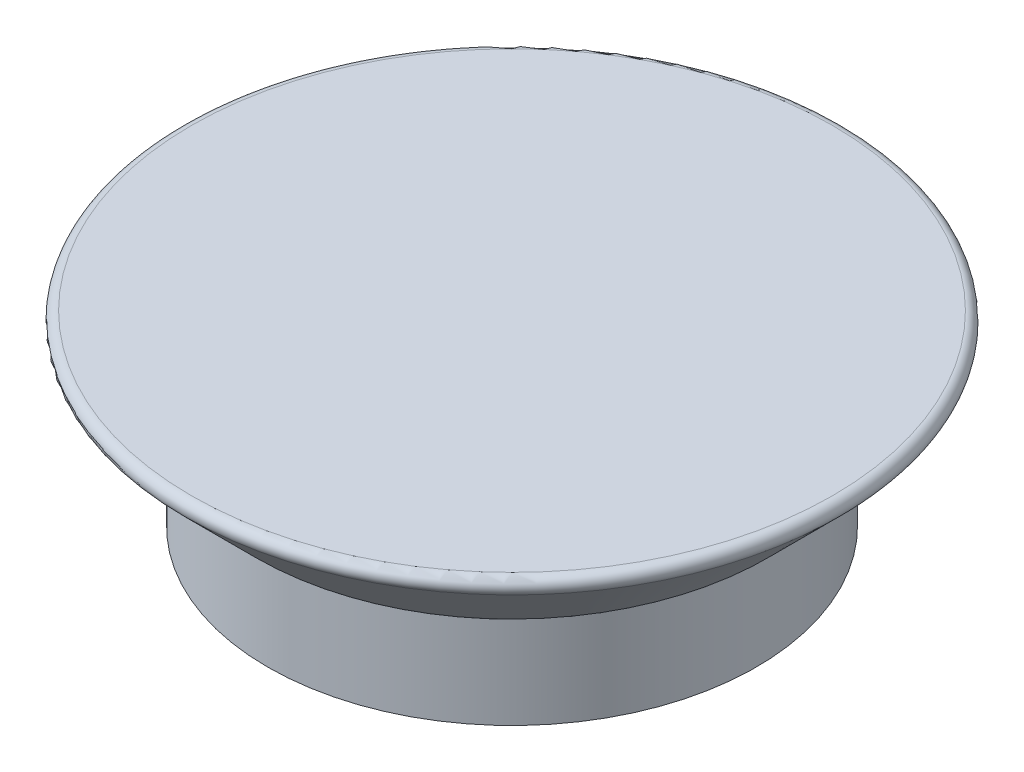
ISO-10303-21;
HEADER;
FILE_DESCRIPTION(('STEP AP214'),'2;1');
FILE_NAME('part.step','',(''),(''),'','','');
FILE_SCHEMA(('AUTOMOTIVE_DESIGN { 1 0 10303 214 1 1 1 1 }'));
ENDSEC;
DATA;
#1=APPLICATION_CONTEXT('core data for automotive mechanical design processes');
#2=APPLICATION_PROTOCOL_DEFINITION('international standard','automotive_design',2000,#1);
#3=PRODUCT_CONTEXT('',#1,'mechanical');
#4=PRODUCT('Part','Part','',(#3));
#5=PRODUCT_RELATED_PRODUCT_CATEGORY('part','',(#4));
#6=PRODUCT_DEFINITION_FORMATION('','',#4);
#7=PRODUCT_DEFINITION_CONTEXT('part definition',#1,'design');
#8=PRODUCT_DEFINITION('design','',#6,#7);
#9=PRODUCT_DEFINITION_SHAPE('','',#8);
#10=(LENGTH_UNIT() NAMED_UNIT(*) SI_UNIT(.MILLI.,.METRE.));
#11=(NAMED_UNIT(*) PLANE_ANGLE_UNIT() SI_UNIT($,.RADIAN.));
#12=(NAMED_UNIT(*) SI_UNIT($,.STERADIAN.) SOLID_ANGLE_UNIT());
#13=UNCERTAINTY_MEASURE_WITH_UNIT(LENGTH_MEASURE(1.E-05),#10,'distance_accuracy_value','');
#14=(GEOMETRIC_REPRESENTATION_CONTEXT(3) GLOBAL_UNCERTAINTY_ASSIGNED_CONTEXT((#13)) GLOBAL_UNIT_ASSIGNED_CONTEXT((#10,
#11,#12)) REPRESENTATION_CONTEXT('',''));
#15=CARTESIAN_POINT('',(0.,0.,0.));
#16=DIRECTION('',(0.,0.,1.));
#17=DIRECTION('',(1.,0.,0.));
#18=AXIS2_PLACEMENT_3D('',#15,#16,#17);
#19=CARTESIAN_POINT('',(0.,110.,0.));
#20=DIRECTION('',(0.,-1.,0.));
#21=DIRECTION('',(0.,0.,-1.));
#22=AXIS2_PLACEMENT_3D('',#19,#20,#21);
#23=CYLINDRICAL_SURFACE('',#22,275.);
#24=CARTESIAN_POINT('',(0.,110.,0.));
#25=DIRECTION('',(0.,1.,0.));
#26=DIRECTION('',(0.,0.,1.));
#27=AXIS2_PLACEMENT_3D('',#24,#25,#26);
#28=CIRCLE('',#27,275.);
#29=CARTESIAN_POINT('',(0.,110.,275.));
#30=VERTEX_POINT('',#29);
#31=EDGE_CURVE('E69',#30,#30,#28,.T.);
#32=ORIENTED_EDGE('',*,*,#31,.F.);
#33=EDGE_LOOP('',(#32));
#34=FACE_BOUND('',#33,.T.);
#35=CARTESIAN_POINT('',(0.,0.,0.));
#36=DIRECTION('',(0.,1.,0.));
#37=DIRECTION('',(0.,0.,1.));
#38=AXIS2_PLACEMENT_3D('',#35,#36,#37);
#39=CIRCLE('',#38,275.);
#40=CARTESIAN_POINT('',(0.,0.,275.));
#41=VERTEX_POINT('',#40);
#42=EDGE_CURVE('E70',#41,#41,#39,.T.);
#43=ORIENTED_EDGE('',*,*,#42,.T.);
#44=EDGE_LOOP('',(#43));
#45=FACE_BOUND('',#44,.T.);
#46=ADVANCED_FACE('F45',(#34,#45),#23,.T.);
#47=CARTESIAN_POINT('',(0.,0.,0.));
#48=DIRECTION('',(0.,1.,0.));
#49=DIRECTION('',(0.,0.,1.));
#50=AXIS2_PLACEMENT_3D('',#47,#48,#49);
#51=PLANE('',#50);
#52=ORIENTED_EDGE('',*,*,#42,.F.);
#53=EDGE_LOOP('',(#52));
#54=FACE_BOUND('',#53,.T.);
#55=ADVANCED_FACE('F82',(#54),#51,.F.);
#56=CARTESIAN_POINT('',(0.,210.,0.));
#57=DIRECTION('',(0.,1.,0.));
#58=DIRECTION('',(0.,0.,1.));
#59=AXIS2_PLACEMENT_3D('',#56,#57,#58);
#60=PLANE('',#59);
#61=CARTESIAN_POINT('',(0.,210.,0.));
#62=DIRECTION('',(0.,1.,0.));
#63=DIRECTION('',(0.,0.,1.));
#64=AXIS2_PLACEMENT_3D('',#61,#62,#63);
#65=CIRCLE('',#64,360.857864376269);
#66=CARTESIAN_POINT('',(0.,210.,360.857864376269));
#67=VERTEX_POINT('',#66);
#68=EDGE_CURVE('E53',#67,#67,#65,.T.);
#69=ORIENTED_EDGE('',*,*,#68,.T.);
#70=EDGE_LOOP('',(#69));
#71=FACE_BOUND('',#70,.T.);
#72=ADVANCED_FACE('F87',(#71),#60,.T.);
#73=CARTESIAN_POINT('',(0.,110.,0.));
#74=DIRECTION('',(0.,1.,0.));
#75=DIRECTION('',(0.,0.,1.));
#76=AXIS2_PLACEMENT_3D('',#73,#74,#75);
#77=PLANE('',#76);
#78=CARTESIAN_POINT('',(0.,110.,0.));
#79=DIRECTION('',(0.,1.,0.));
#80=DIRECTION('',(0.,0.,1.));
#81=AXIS2_PLACEMENT_3D('',#78,#79,#80);
#82=CIRCLE('',#81,280.857864376269);
#83=CARTESIAN_POINT('',(0.,110.,280.857864376269));
#84=VERTEX_POINT('',#83);
#85=EDGE_CURVE('E63',#84,#84,#82,.F.);
#86=ORIENTED_EDGE('',*,*,#85,.T.);
#87=EDGE_LOOP('',(#86));
#88=FACE_BOUND('',#87,.T.);
#89=ORIENTED_EDGE('',*,*,#31,.T.);
#90=EDGE_LOOP('',(#89));
#91=FACE_BOUND('',#90,.T.);
#92=ADVANCED_FACE('F78',(#88,#91),#77,.F.);
#93=CARTESIAN_POINT('',(0.,200.,0.));
#94=DIRECTION('',(0.,1.,0.));
#95=DIRECTION('',(0.,0.,1.));
#96=AXIS2_PLACEMENT_3D('',#93,#94,#95);
#97=CONICAL_SURFACE('',#96,375.,0.785398163397451);
#98=CARTESIAN_POINT('',(0.,192.928932188134,0.));
#99=DIRECTION('',(0.,-1.,0.));
#100=DIRECTION('',(0.,0.,-1.));
#101=AXIS2_PLACEMENT_3D('',#98,#99,#100);
#102=CIRCLE('',#101,367.928932188135);
#103=CARTESIAN_POINT('',(0.,192.928932188134,-367.928932188135));
#104=VERTEX_POINT('',#103);
#105=EDGE_CURVE('E10',#104,#104,#102,.T.);
#106=ORIENTED_EDGE('',*,*,#105,.T.);
#107=EDGE_LOOP('',(#106));
#108=FACE_BOUND('',#107,.T.);
#109=CARTESIAN_POINT('',(0.,112.928932188134,0.));
#110=DIRECTION('',(0.,1.,0.));
#111=DIRECTION('',(0.,0.,1.));
#112=AXIS2_PLACEMENT_3D('',#109,#110,#111);
#113=CIRCLE('',#112,287.928932188134);
#114=CARTESIAN_POINT('',(0.,112.928932188134,287.928932188134));
#115=VERTEX_POINT('',#114);
#116=EDGE_CURVE('E58',#115,#115,#113,.T.);
#117=ORIENTED_EDGE('',*,*,#116,.T.);
#118=EDGE_LOOP('',(#117));
#119=FACE_BOUND('',#118,.T.);
#120=ADVANCED_FACE('F96',(#108,#119),#97,.T.);
#121=CARTESIAN_POINT('',(0.,120.,0.));
#122=DIRECTION('',(0.,1.,0.));
#123=DIRECTION('',(0.,0.,1.));
#124=AXIS2_PLACEMENT_3D('',#121,#122,#123);
#125=TOROIDAL_SURFACE('',#124,280.857864376269,10.);
#126=ORIENTED_EDGE('',*,*,#116,.F.);
#127=EDGE_LOOP('',(#126));
#128=FACE_BOUND('',#127,.T.);
#129=ORIENTED_EDGE('',*,*,#85,.F.);
#130=EDGE_LOOP('',(#129));
#131=FACE_BOUND('',#130,.T.);
#132=ADVANCED_FACE('F100',(#128,#131),#125,.T.);
#133=CARTESIAN_POINT('',(0.,200.,0.));
#134=DIRECTION('',(0.,1.,0.));
#135=DIRECTION('',(0.,0.,1.));
#136=AXIS2_PLACEMENT_3D('',#133,#134,#135);
#137=TOROIDAL_SURFACE('',#136,360.857864376269,10.);
#138=ORIENTED_EDGE('',*,*,#105,.F.);
#139=EDGE_LOOP('',(#138));
#140=FACE_BOUND('',#139,.T.);
#141=ORIENTED_EDGE('',*,*,#68,.F.);
#142=EDGE_LOOP('',(#141));
#143=FACE_BOUND('',#142,.T.);
#144=ADVANCED_FACE('F47',(#140,#143),#137,.T.);
#145=CLOSED_SHELL('',(#46,#55,#72,#92,#120,#132,#144));
#146=MANIFOLD_SOLID_BREP('B2',#145);
#147=ADVANCED_BREP_SHAPE_REPRESENTATION('',(#18,#146),#14);
#148=SHAPE_DEFINITION_REPRESENTATION(#9,#147);
ENDSEC;
END-ISO-10303-21;
